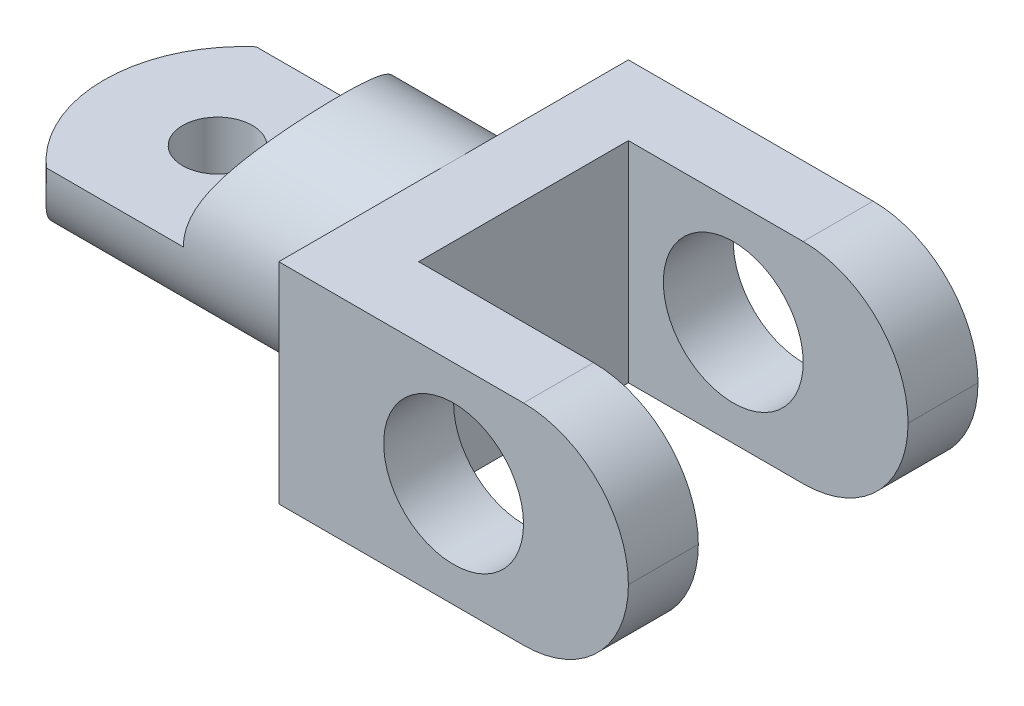
ISO-10303-21;
HEADER;
FILE_DESCRIPTION(('STEP AP214'),'2;1');
FILE_NAME('part.step','',(''),(''),'','','');
FILE_SCHEMA(('AUTOMOTIVE_DESIGN { 1 0 10303 214 1 1 1 1 }'));
ENDSEC;
DATA;
#1=APPLICATION_CONTEXT('core data for automotive mechanical design processes');
#2=APPLICATION_PROTOCOL_DEFINITION('international standard','automotive_design',2000,#1);
#3=PRODUCT_CONTEXT('',#1,'mechanical');
#4=PRODUCT('Part','Part','',(#3));
#5=PRODUCT_RELATED_PRODUCT_CATEGORY('part','',(#4));
#6=PRODUCT_DEFINITION_FORMATION('','',#4);
#7=PRODUCT_DEFINITION_CONTEXT('part definition',#1,'design');
#8=PRODUCT_DEFINITION('design','',#6,#7);
#9=PRODUCT_DEFINITION_SHAPE('','',#8);
#10=(LENGTH_UNIT() NAMED_UNIT(*) SI_UNIT(.MILLI.,.METRE.));
#11=(NAMED_UNIT(*) PLANE_ANGLE_UNIT() SI_UNIT($,.RADIAN.));
#12=(NAMED_UNIT(*) SI_UNIT($,.STERADIAN.) SOLID_ANGLE_UNIT());
#13=UNCERTAINTY_MEASURE_WITH_UNIT(LENGTH_MEASURE(1.E-05),#10,'distance_accuracy_value','');
#14=(GEOMETRIC_REPRESENTATION_CONTEXT(3) GLOBAL_UNCERTAINTY_ASSIGNED_CONTEXT((#13)) GLOBAL_UNIT_ASSIGNED_CONTEXT((#10,
#11,#12)) REPRESENTATION_CONTEXT('',''));
#15=CARTESIAN_POINT('',(0.,0.,0.));
#16=DIRECTION('',(0.,0.,1.));
#17=DIRECTION('',(1.,0.,0.));
#18=AXIS2_PLACEMENT_3D('',#15,#16,#17);
#19=CARTESIAN_POINT('',(-32.93364,0.,0.));
#20=DIRECTION('',(1.,0.,0.));
#21=DIRECTION('',(0.,0.,-1.));
#22=AXIS2_PLACEMENT_3D('',#19,#20,#21);
#23=CYLINDRICAL_SURFACE('',#22,4.70535);
#24=CARTESIAN_POINT('',(-24.7015,-4.70535,0.));
#25=CARTESIAN_POINT('',(-24.7014996161154,-4.70535022983505,-0.0855145321097443));
#26=CARTESIAN_POINT('',(-24.708522031816,-4.70299730140912,-0.171026775501489));
#27=CARTESIAN_POINT('',(-24.7363403430874,-4.69384277612578,-0.339532769312276));
#28=CARTESIAN_POINT('',(-24.7571376906205,-4.68704071030298,-0.422526253274096));
#29=CARTESIAN_POINT('',(-24.8117140692554,-4.66972705620134,-0.583541065045557));
#30=CARTESIAN_POINT('',(-24.8454714207762,-4.65922166525696,-0.661570444089321));
#31=CARTESIAN_POINT('',(-24.9249116493427,-4.63557382539462,-0.810859955176995));
#32=CARTESIAN_POINT('',(-24.9705968728639,-4.62243085772497,-0.88211875153175));
#33=CARTESIAN_POINT('',(-25.074255385149,-4.59438283560297,-1.01830874385799));
#34=CARTESIAN_POINT('',(-25.1325673383853,-4.57943562302643,-1.08297343938973));
#35=CARTESIAN_POINT('',(-25.2591039716202,-4.54969587110564,-1.2018094072363));
#36=CARTESIAN_POINT('',(-25.3273308240588,-4.53490336642264,-1.25597837376121));
#37=CARTESIAN_POINT('',(-25.4741586183399,-4.50668415572133,-1.3538055365009));
#38=CARTESIAN_POINT('',(-25.553001090004,-4.49330882955565,-1.39711747366414));
#39=CARTESIAN_POINT('',(-25.7173684990934,-4.47007929007992,-1.46975327892674));
#40=CARTESIAN_POINT('',(-25.802891391783,-4.46022400446645,-1.49908140780102));
#41=CARTESIAN_POINT('',(-25.9751619234297,-4.44559428864523,-1.54191764886191));
#42=CARTESIAN_POINT('',(-26.0617714328357,-4.44065999807536,-1.5559250491025));
#43=CARTESIAN_POINT('',(-26.2362411160881,-4.43595811225604,-1.56928300963242));
#44=CARTESIAN_POINT('',(-26.3241008958487,-4.43618892349954,-1.56863809036889));
#45=CARTESIAN_POINT('',(-26.4943203358822,-4.44165105751254,-1.55309742623159));
#46=CARTESIAN_POINT('',(-26.5767480731511,-4.4466538044265,-1.53885306688115));
#47=CARTESIAN_POINT('',(-26.7379692006308,-4.4607221406621,-1.49758041321599));
#48=CARTESIAN_POINT('',(-26.8167621551307,-4.46978821567704,-1.47055059062181));
#49=CARTESIAN_POINT('',(-26.9699579684025,-4.4911247310606,-1.40404742230473));
#50=CARTESIAN_POINT('',(-27.0442698267487,-4.50344436794388,-1.36438091610808));
#51=CARTESIAN_POINT('',(-27.1853885784615,-4.52987926004596,-1.2738644704627));
#52=CARTESIAN_POINT('',(-27.2521932984569,-4.54399503275005,-1.22301130493217));
#53=CARTESIAN_POINT('',(-27.3800619304809,-4.57333118522814,-1.10843575537268));
#54=CARTESIAN_POINT('',(-27.4406451888607,-4.5885707926264,-1.04418078902495));
#55=CARTESIAN_POINT('',(-27.5503016112722,-4.61779385717256,-0.906235685442383));
#56=CARTESIAN_POINT('',(-27.5993736749787,-4.63177719415809,-0.832544647277906));
#57=CARTESIAN_POINT('',(-27.6850008965941,-4.65709521708252,-0.676800988068298));
#58=CARTESIAN_POINT('',(-27.721427457705,-4.66840233909108,-0.594672876408155));
#59=CARTESIAN_POINT('',(-27.7797989886726,-4.68689381864689,-0.424987999705921));
#60=CARTESIAN_POINT('',(-27.8017489805306,-4.69407960579495,-0.337433128779434));
#61=CARTESIAN_POINT('',(-27.8296931846708,-4.70328204077229,-0.163449314074051));
#62=CARTESIAN_POINT('',(-27.8363369096445,-4.7055089690086,-0.0771356729421199));
#63=CARTESIAN_POINT('',(-27.8353299327732,-4.70517332630032,0.0953902095652675));
#64=CARTESIAN_POINT('',(-27.8276816393399,-4.7026115623196,0.181602465575892));
#65=CARTESIAN_POINT('',(-27.7988217621485,-4.69312515144589,0.348879971030113));
#66=CARTESIAN_POINT('',(-27.778008690851,-4.6863287783241,0.43002196531827));
#67=CARTESIAN_POINT('',(-27.7239081553653,-4.66918612874413,0.587629898466098));
#68=CARTESIAN_POINT('',(-27.690619100925,-4.65883939975374,0.664095239769904));
#69=CARTESIAN_POINT('',(-27.6115415175446,-4.63530841316891,0.812419224255344));
#70=CARTESIAN_POINT('',(-27.5654474908519,-4.62205673068844,0.884103991694245));
#71=CARTESIAN_POINT('',(-27.4624274408014,-4.59421835785716,1.01893252593397));
#72=CARTESIAN_POINT('',(-27.4054981140415,-4.57963126107889,1.08207367793754));
#73=CARTESIAN_POINT('',(-27.2793691187437,-4.54992745805763,1.20100316857154));
#74=CARTESIAN_POINT('',(-27.2097300069561,-4.53481674147844,1.25632807925136));
#75=CARTESIAN_POINT('',(-27.0618320895245,-4.506450801977,1.35456366460611));
#76=CARTESIAN_POINT('',(-26.9835732152667,-4.4931955938266,1.39747424045244));
#77=CARTESIAN_POINT('',(-26.820626194912,-4.47017117837993,1.46946324868461));
#78=CARTESIAN_POINT('',(-26.7359516528387,-4.46039483213322,1.49857004905754));
#79=CARTESIAN_POINT('',(-26.5625022115977,-4.44557652053025,1.54198068166263));
#80=CARTESIAN_POINT('',(-26.4737291744537,-4.4405324270031,1.55629116833317));
#81=CARTESIAN_POINT('',(-26.2995015503959,-4.4359914676265,1.56918454505362));
#82=CARTESIAN_POINT('',(-26.2141103138388,-4.43622333499205,1.5685365107298));
#83=CARTESIAN_POINT('',(-26.0447210861262,-4.44153764745703,1.55342351923217));
#84=CARTESIAN_POINT('',(-25.9607230126049,-4.4466198047527,1.53895938187045));
#85=CARTESIAN_POINT('',(-25.7980864293147,-4.46086025054263,1.49716875271142));
#86=CARTESIAN_POINT('',(-25.7193765615461,-4.46993955330204,1.47009093913399));
#87=CARTESIAN_POINT('',(-25.5675569147976,-4.4911222348777,1.40404303829217));
#88=CARTESIAN_POINT('',(-25.4944483820726,-4.50322628413912,1.36507031405663));
#89=CARTESIAN_POINT('',(-25.352453598754,-4.52975222752959,1.27435712414189));
#90=CARTESIAN_POINT('',(-25.283890171246,-4.54425214120793,1.22213428702373));
#91=CARTESIAN_POINT('',(-25.1562514852743,-4.57360871845319,1.10721923512823));
#92=CARTESIAN_POINT('',(-25.0971789168276,-4.58846548179615,1.04452406238552));
#93=CARTESIAN_POINT('',(-24.9878838272265,-4.61755533456804,0.907516333421731));
#94=CARTESIAN_POINT('',(-24.9380947810946,-4.63174170563494,0.832846822697227));
#95=CARTESIAN_POINT('',(-24.8518294493216,-4.65725529047547,0.675731748113261));
#96=CARTESIAN_POINT('',(-24.8153497350661,-4.66858324037422,0.593288193820456));
#97=CARTESIAN_POINT('',(-24.7582870844583,-4.68666745409472,0.426797157270762));
#98=CARTESIAN_POINT('',(-24.7370600086526,-4.69360725257518,0.342990704812426));
#99=CARTESIAN_POINT('',(-24.7086685953471,-4.70294778486534,0.172788243385497));
#100=CARTESIAN_POINT('',(-24.7015003878279,-4.70534976780404,0.0863929537028502));
#101=CARTESIAN_POINT('',(-24.7015,-4.70535,0.));
#102=B_SPLINE_CURVE_WITH_KNOTS('',3,(#24,#25,#26,#27,#28,#29,#30,#31,#32,#33,#34,#35,#36,#37,
#38,#39,#40,#41,#42,#43,#44,#45,#46,#47,#48,#49,#50,#51,#52,#53,#54,#55,#56,#57,#58,#59,#60,#61,
#62,#63,#64,#65,#66,#67,#68,#69,#70,#71,#72,#73,#74,#75,#76,#77,#78,#79,#80,#81,#82,#83,#84,#85,
#86,#87,#88,#89,#90,#91,#92,#93,#94,#95,#96,#97,#98,#99,#100,#101),.UNSPECIFIED.,.T.,.F.,(4,2,2,
2,2,2,2,2,2,2,2,2,2,2,2,2,2,2,2,2,2,2,2,2,2,2,2,2,2,2,2,2,2,2,2,2,2,2,4),(0.,0.256225681443812,
0.51247837494287,0.768304261961474,1.02418051354471,1.28803329043318,1.5519439671564,
1.82342852197953,2.09483030429034,2.35709640988729,2.61928160379203,2.86950736278113,
3.11976303946304,3.37404407341133,3.62839853494279,3.89600931213361,4.16364565912808,
4.43392902400873,4.70411857671873,4.96261312679493,5.22106412072831,5.47204319705912,
5.72305427534544,5.98066197758932,6.2383483439136,6.50772315789241,6.77710011626377,
7.04592105600955,7.31462104458194,7.56953840677607,7.82444064376767,8.07451737801236,
8.32464959184241,8.58568179091256,8.84678784494166,9.11804740906181,9.38923704463375,
9.64816601120148,9.90702369174224),.UNSPECIFIED.);
#103=CARTESIAN_POINT('',(-24.7015,-4.70535,0.));
#104=VERTEX_POINT('',#103);
#105=EDGE_CURVE('E160',#104,#104,#102,.T.);
#106=ORIENTED_EDGE('',*,*,#105,.T.);
#107=EDGE_LOOP('',(#106));
#108=FACE_BOUND('',#107,.T.);
#109=CARTESIAN_POINT('',(-15.68196,0.,0.));
#110=DIRECTION('',(-1.,0.,0.));
#111=DIRECTION('',(0.,0.,1.));
#112=AXIS2_PLACEMENT_3D('',#109,#110,#111);
#113=CIRCLE('',#112,4.70535);
#114=CARTESIAN_POINT('',(-15.68196,4.70535,0.));
#115=VERTEX_POINT('',#114);
#116=CARTESIAN_POINT('',(-15.68196,-4.70535,0.));
#117=VERTEX_POINT('',#116);
#118=EDGE_CURVE('E154',#115,#117,#113,.T.);
#119=ORIENTED_EDGE('',*,*,#118,.T.);
#120=EDGE_CURVE('E193',#117,#115,#113,.T.);
#121=ORIENTED_EDGE('',*,*,#120,.T.);
#122=EDGE_LOOP('',(#119,#121));
#123=FACE_BOUND('',#122,.T.);
#124=DIRECTION('',(1.,0.,0.));
#125=VECTOR('',#124,1.);
#126=CARTESIAN_POINT('',(-32.93364,0.0012699999999994,-4.70534982860998));
#127=LINE('',#126,#125);
#128=CARTESIAN_POINT('',(-23.0988410169119,0.0012699999999994,-4.70534982860998));
#129=VERTEX_POINT('',#128);
#130=CARTESIAN_POINT('',(-29.2423888381773,0.0012699999999994,-4.70534982860998));
#131=VERTEX_POINT('',#130);
#132=EDGE_CURVE('E155',#129,#131,#127,.F.);
#133=ORIENTED_EDGE('',*,*,#132,.F.);
#134=CARTESIAN_POINT('',(-23.0988410169119,0.0012699999999994,-4.70534982860998));
#135=CARTESIAN_POINT('',(-23.0988657554299,0.0909475151243943,-4.70534634674592));
#136=CARTESIAN_POINT('',(-23.0953910276751,0.180588645750009,-4.70273871759652));
#137=CARTESIAN_POINT('',(-23.0818847629461,0.358938644952971,-4.69248267383832));
#138=CARTESIAN_POINT('',(-23.0718642655318,0.447648828102165,-4.68484274611233));
#139=CARTESIAN_POINT('',(-23.0458784004873,0.622422742377658,-4.66482153823005));
#140=CARTESIAN_POINT('',(-23.0299932509388,0.708505949799684,-4.65250417496624));
#141=CARTESIAN_POINT('',(-22.992953125703,0.878778823112358,-4.62336783487542));
#142=CARTESIAN_POINT('',(-22.9717955593506,0.962967535881819,-4.60654664473583));
#143=CARTESIAN_POINT('',(-22.9166803848137,1.15852863915808,-4.56195589137762));
#144=CARTESIAN_POINT('',(-22.8808431438713,1.26897087872348,-4.53241865680864));
#145=CARTESIAN_POINT('',(-22.8028019025787,1.48533143299549,-4.46619752977552));
#146=CARTESIAN_POINT('',(-22.7605957058307,1.59124817080589,-4.42951117058777));
#147=CARTESIAN_POINT('',(-22.6264256041167,1.90351618611349,-4.30894436285809));
#148=CARTESIAN_POINT('',(-22.5273495568761,2.10297753581323,-4.2148888388495));
#149=CARTESIAN_POINT('',(-22.3546143730915,2.42195211062431,-4.03685395813513));
#150=CARTESIAN_POINT('',(-22.2830893606705,2.54646974586862,-3.95944228105172));
#151=CARTESIAN_POINT('',(-22.1387004671473,2.7873469870482,-3.79372955695013));
#152=CARTESIAN_POINT('',(-22.0658361295731,2.9037037439761,-3.70542473646463));
#153=CARTESIAN_POINT('',(-21.9210271727023,3.12776531567731,-3.51833159784601));
#154=CARTESIAN_POINT('',(-21.849080956053,3.23548761750763,-3.41956546002147));
#155=CARTESIAN_POINT('',(-21.7077612725796,3.4420982312789,-3.21150698145381));
#156=CARTESIAN_POINT('',(-21.6383881221965,3.54098545875723,-3.10221335192417));
#157=CARTESIAN_POINT('',(-21.4631368420728,3.78632465232271,-2.80370491957426));
#158=CARTESIAN_POINT('',(-21.3606061832336,3.92529627766446,-2.60618689876626));
#159=CARTESIAN_POINT('',(-21.1738541093168,4.17397008824256,-2.18580217327114));
#160=CARTESIAN_POINT('',(-21.0896077093681,4.28371226183729,-1.96297070149543));
#161=CARTESIAN_POINT('',(-20.9578844644816,4.45353351117444,-1.53323364460917));
#162=CARTESIAN_POINT('',(-20.9066742099656,4.51875965221693,-1.32952421193926));
#163=CARTESIAN_POINT('',(-20.8257753666274,4.62132023243213,-0.911059259720844));
#164=CARTESIAN_POINT('',(-20.796074513007,4.65867056694024,-0.69631011002943));
#165=CARTESIAN_POINT('',(-20.7606222491877,4.70321632081256,-0.260950977390391));
#166=CARTESIAN_POINT('',(-20.7549526294951,4.71030875770114,-0.0403235466377385));
#167=CARTESIAN_POINT('',(-20.7683092439565,4.69355385492371,0.398991155754634));
#168=CARTESIAN_POINT('',(-20.787336675558,4.66970501505613,0.617678332802662));
#169=CARTESIAN_POINT('',(-20.8467442584414,4.59476365295197,1.03490227911205));
#170=CARTESIAN_POINT('',(-20.8859297972039,4.54519410189197,1.23389146416722));
#171=CARTESIAN_POINT('',(-20.9820947862974,4.42238992044573,1.61982739337999));
#172=CARTESIAN_POINT('',(-21.0390795127712,4.34914827280951,1.80677054693319));
#173=CARTESIAN_POINT('',(-21.1736615519921,4.17383676953626,2.18326399505947));
#174=CARTESIAN_POINT('',(-21.252725233109,4.06965493942037,2.37129721605742));
#175=CARTESIAN_POINT('',(-21.4233499839093,3.84005265181976,2.72750660049095));
#176=CARTESIAN_POINT('',(-21.5149153784451,3.71462484085475,2.89567585445519));
#177=CARTESIAN_POINT('',(-21.725555358748,3.41755863516449,3.24395453673368));
#178=CARTESIAN_POINT('',(-21.846417742245,3.24172002985135,3.41942425488972));
#179=CARTESIAN_POINT('',(-22.0298535425632,2.95991615910607,3.65985085459584));
#180=CARTESIAN_POINT('',(-22.0914485595907,2.86281680653403,3.73629285873797));
#181=CARTESIAN_POINT('',(-22.2141352289726,2.66267701070689,3.88146222834917));
#182=CARTESIAN_POINT('',(-22.2752269346418,2.55963720620681,3.95019042092295));
#183=CARTESIAN_POINT('',(-22.3893276221195,2.35853615947102,4.07308868194628));
#184=CARTESIAN_POINT('',(-22.4425225267463,2.26104976054067,4.1280289557518));
#185=CARTESIAN_POINT('',(-22.5461771982672,2.06126255585368,4.23133051323279));
#186=CARTESIAN_POINT('',(-22.5966375280868,1.95896274912322,4.27969315406438));
#187=CARTESIAN_POINT('',(-22.6931007025509,1.75009596771034,4.36924657300909));
#188=CARTESIAN_POINT('',(-22.7391288280624,1.64355878316777,4.41047924481135));
#189=CARTESIAN_POINT('',(-22.8253714197124,1.42563726714236,4.48566093507793));
#190=CARTESIAN_POINT('',(-22.8655867965046,1.31425369848275,4.51961109486044));
#191=CARTESIAN_POINT('',(-22.9319961008841,1.106374644482,4.57446614074584));
#192=CARTESIAN_POINT('',(-22.9594118539466,1.0105990527767,4.59660956943875));
#193=CARTESIAN_POINT('',(-23.0076884855344,0.816305181277628,4.6350585036011));
#194=CARTESIAN_POINT('',(-23.0285538799964,0.71778884223991,4.65136803215408));
#195=CARTESIAN_POINT('',(-23.0628720093422,0.517042827937659,4.67796563447762));
#196=CARTESIAN_POINT('',(-23.0762050031676,0.414779278305618,4.68815659345317));
#197=CARTESIAN_POINT('',(-23.0942309768567,0.208793097816997,4.70186111301328));
#198=CARTESIAN_POINT('',(-23.0989014575419,0.1050673705098,4.70535728596538));
#199=CARTESIAN_POINT('',(-23.0988410169118,0.00126999999995225,4.70534982861001));
#200=B_SPLINE_CURVE_WITH_KNOTS('',3,(#134,#135,#136,#137,#138,#139,#140,#141,#142,#143,#144,
#145,#146,#147,#148,#149,#150,#151,#152,#153,#154,#155,#156,#157,#158,#159,#160,#161,#162,#163,
#164,#165,#166,#167,#168,#169,#170,#171,#172,#173,#174,#175,#176,#177,#178,#179,#180,#181,#182,
#183,#184,#185,#186,#187,#188,#189,#190,#191,#192,#193,#194,#195,#196,#197,#198,#199),
.UNSPECIFIED.,.F.,.F.,(4,2,2,2,2,2,2,2,2,2,2,2,2,2,2,2,2,2,2,2,2,2,2,2,2,2,2,2,2,2,2,2,4),(0.,
0.268874197636215,0.537296100716804,0.802174842313111,1.06718399276845,1.42603073555568,
1.78500151423531,2.50742609393122,2.99637127648818,3.48548631150681,3.97358432120223,
4.46174216049368,5.24565355624022,6.02848692126835,6.685505846355,7.34214983943332,
8.00102694021548,8.6599359881413,9.28365592789638,9.90756093022912,10.5921885753029,
11.2770536639379,12.1025577067681,12.5165363679208,12.9304705981884,13.3019103859731,
13.673273418332,14.0423742448523,14.4114171834124,14.717214257313,15.0228000437777,
15.3331160367633,15.6442368920448),.UNSPECIFIED.);
#201=CARTESIAN_POINT('',(-23.0988410169119,0.0012699999999994,4.70534982860998));
#202=VERTEX_POINT('',#201);
#203=EDGE_CURVE('E159',#129,#202,#200,.T.);
#204=ORIENTED_EDGE('',*,*,#203,.T.);
#205=DIRECTION('',(1.,0.,0.));
#206=VECTOR('',#205,1.);
#207=CARTESIAN_POINT('',(-32.93364,0.0012699999999994,4.70534982860998));
#208=LINE('',#207,#206);
#209=CARTESIAN_POINT('',(-29.2423888381773,0.0012699999999994,4.70534982860998));
#210=VERTEX_POINT('',#209);
#211=EDGE_CURVE('E143',#210,#202,#208,.T.);
#212=ORIENTED_EDGE('',*,*,#211,.F.);
#213=CARTESIAN_POINT('',(-29.2423886438392,0.,-4.70535));
#214=CARTESIAN_POINT('',(-29.2423781036386,0.109852184350706,-4.70535526424458));
#215=CARTESIAN_POINT('',(-29.2467697314219,0.219667110233113,-4.70149598803322));
#216=CARTESIAN_POINT('',(-29.2640348971921,0.438134546105287,-4.68618591239452));
#217=CARTESIAN_POINT('',(-29.2769112650729,0.54678665597282,-4.67473258013305));
#218=CARTESIAN_POINT('',(-29.3104387953515,0.762074678935267,-4.64450325701784));
#219=CARTESIAN_POINT('',(-29.3311070631425,0.868705610099921,-4.62571115223157));
#220=CARTESIAN_POINT('',(-29.3791500944313,1.07900131706475,-4.58122711366669));
#221=CARTESIAN_POINT('',(-29.4065289797152,1.1826642259806,-4.55553093834289));
#222=CARTESIAN_POINT('',(-29.4960578370946,1.48542183731978,-4.46960823938729));
#223=CARTESIAN_POINT('',(-29.5661796514996,1.67957591940202,-4.40006089981239));
#224=CARTESIAN_POINT('',(-29.7191712849193,2.05265823040149,-4.2389033156919));
#225=CARTESIAN_POINT('',(-29.8020395627461,2.231588296013,-4.14729573771566));
#226=CARTESIAN_POINT('',(-29.9917798862866,2.61023390112124,-3.92238679142222));
#227=CARTESIAN_POINT('',(-30.1000441907871,2.806453639202,-3.78437143264363));
#228=CARTESIAN_POINT('',(-30.3162773177348,3.1762213835291,-3.47984731687057));
#229=CARTESIAN_POINT('',(-30.4242454637009,3.34973532938806,-3.31329659965258));
#230=CARTESIAN_POINT('',(-30.5906794167916,3.60740586030013,-3.02458140691122));
#231=CARTESIAN_POINT('',(-30.6517687958237,3.69967377677122,-2.91107483331235));
#232=CARTESIAN_POINT('',(-30.7694405678904,3.87424321041122,-2.67435764427401));
#233=CARTESIAN_POINT('',(-30.8260219464024,3.95654248630038,-2.5511448567958));
#234=CARTESIAN_POINT('',(-30.9329711277542,4.10998819208495,-2.29574666656814));
#235=CARTESIAN_POINT('',(-30.9833505912573,4.18115562214094,-2.16357884966529));
#236=CARTESIAN_POINT('',(-31.0764522235572,4.31133228505023,-1.89091540046174));
#237=CARTESIAN_POINT('',(-31.1191784415112,4.37034794961106,-1.75042422453345));
#238=CARTESIAN_POINT('',(-31.2106408829479,4.49577231048035,-1.40501669128488));
#239=CARTESIAN_POINT('',(-31.2550779120762,4.55588373664077,-1.19658392023833));
#240=CARTESIAN_POINT('',(-31.3227332521544,4.64698787934182,-0.770248195668842));
#241=CARTESIAN_POINT('',(-31.3459699975754,4.67800589439448,-0.552353642604854));
#242=CARTESIAN_POINT('',(-31.3693228428584,4.7091783554257,-0.112512137753899));
#243=CARTESIAN_POINT('',(-31.369378865691,4.70925260505101,0.109443852952974));
#244=CARTESIAN_POINT('',(-31.3462030666501,4.67831751825663,0.549951084721422));
#245=CARTESIAN_POINT('',(-31.3229658517741,4.64730098349551,0.768501525407665));
#246=CARTESIAN_POINT('',(-31.2563977135414,4.55766107222342,1.18853712538534));
#247=CARTESIAN_POINT('',(-31.2137822504962,4.50001960353206,1.39035039647423));
#248=CARTESIAN_POINT('',(-31.111815564027,4.36030511636022,1.78075672405692));
#249=CARTESIAN_POINT('',(-31.0524606915347,4.27822677060259,1.96934688680531));
#250=CARTESIAN_POINT('',(-30.9135231900889,4.08258089297266,2.35021983096924));
#251=CARTESIAN_POINT('',(-30.8324462316971,3.96656608597694,2.5406914254123));
#252=CARTESIAN_POINT('',(-30.6594296510195,3.71179406730549,2.90026988676098));
#253=CARTESIAN_POINT('',(-30.5674807908019,3.5730174754529,3.06935832812024));
#254=CARTESIAN_POINT('',(-30.3592977087115,3.24596389883925,3.41636446557974));
#255=CARTESIAN_POINT('',(-30.241844352633,3.05331966804005,3.58947565923654));
#256=CARTESIAN_POINT('',(-30.0672388311909,2.74468950466984,3.82409583222164));
#257=CARTESIAN_POINT('',(-30.0092611961918,2.63845790923503,3.89816922573013));
#258=CARTESIAN_POINT('',(-29.89530972759,2.41949100776033,4.03772563540655));
#259=CARTESIAN_POINT('',(-29.8393354483853,2.30675716275422,4.10321057062932));
#260=CARTESIAN_POINT('',(-29.6982529727591,2.00460810451473,4.26217811297028));
#261=CARTESIAN_POINT('',(-29.615998341133,1.81005106987703,4.34864134162991));
#262=CARTESIAN_POINT('',(-29.4697842119119,1.40510733000532,4.49579373379173));
#263=CARTESIAN_POINT('',(-29.4057834769492,1.19475768308128,4.55654114478818));
#264=CARTESIAN_POINT('',(-29.3161845079045,0.804032003647592,4.63954843488105));
#265=CARTESIAN_POINT('',(-29.2854891143029,0.625978170863034,4.66705012143081));
#266=CARTESIAN_POINT('',(-29.2470316941374,0.265520816202033,4.70132776783651));
#267=CARTESIAN_POINT('',(-29.2392403268556,0.0831231612839006,4.70813024436992));
#268=CARTESIAN_POINT('',(-29.2478880907919,-0.280687732442082,4.70049573090491));
#269=CARTESIAN_POINT('',(-29.2643361406798,-0.462100584247259,4.68605092316795));
#270=CARTESIAN_POINT('',(-29.318728750488,-0.818964817820973,4.63704654133944));
#271=CARTESIAN_POINT('',(-29.3567099991974,-0.994405481805163,4.60245263396248));
#272=CARTESIAN_POINT('',(-29.4663752428529,-1.4001436349593,4.49874399073932));
#273=CARTESIAN_POINT('',(-29.545352965329,-1.62639498407808,4.42155476298703));
#274=CARTESIAN_POINT('',(-29.676891297273,-1.95057026273838,4.28362828343601));
#275=CARTESIAN_POINT('',(-29.7229834723367,-2.05622057873387,4.23388439630259));
#276=CARTESIAN_POINT('',(-29.8182028767563,-2.26248800994113,4.12733744152157));
#277=CARTESIAN_POINT('',(-29.8673298317845,-2.36310557860229,4.07053501145974));
#278=CARTESIAN_POINT('',(-30.0209286377155,-2.66425313262267,3.88573249206578));
#279=CARTESIAN_POINT('',(-30.1283866507885,-2.85652149864566,3.74657129089246));
#280=CARTESIAN_POINT('',(-30.3422133211457,-3.21850876766912,3.44058960286626));
#281=CARTESIAN_POINT('',(-30.4485814224061,-3.38821664306392,3.27375567844108));
#282=CARTESIAN_POINT('',(-30.6129071464193,-3.64117152326026,2.98385658332705));
#283=CARTESIAN_POINT('',(-30.673554852661,-3.73231053100655,2.86912555524978));
#284=CARTESIAN_POINT('',(-30.790147807959,-3.9045032138558,2.6299971308481));
#285=CARTESIAN_POINT('',(-30.8460919886437,-3.98555459962638,2.50559755066497));
#286=CARTESIAN_POINT('',(-30.9515848109429,-4.13638108049479,2.24786807062359));
#287=CARTESIAN_POINT('',(-31.0011442192252,-4.20617521020173,2.1145537961438));
#288=CARTESIAN_POINT('',(-31.0924122011603,-4.33344441706307,1.83970607131538));
#289=CARTESIAN_POINT('',(-31.1341250103963,-4.39092614277319,1.69817710954846));
#290=CARTESIAN_POINT('',(-31.2227221080446,-4.51217884140658,1.35133510660751));
#291=CARTESIAN_POINT('',(-31.2652967763868,-4.56968503622855,1.14264216540159));
#292=CARTESIAN_POINT('',(-31.329152403373,-4.65557895598727,0.716330353006355));
#293=CARTESIAN_POINT('',(-31.3504523995692,-4.68399271474263,0.498719643734798));
#294=CARTESIAN_POINT('',(-31.3700189244408,-4.71010263649891,0.0600711460473843));
#295=CARTESIAN_POINT('',(-31.3682313830446,-4.7077266912251,-0.16097347592317));
#296=CARTESIAN_POINT('',(-31.3416419215364,-4.6722223600837,-0.599178024248241));
#297=CARTESIAN_POINT('',(-31.3168338703601,-4.63908578171974,-0.816336900004577));
#298=CARTESIAN_POINT('',(-31.2473641544198,-4.54544639418937,-1.23443856403377));
#299=CARTESIAN_POINT('',(-31.2032997507176,-4.48576595761728,-1.43566909732061));
#300=CARTESIAN_POINT('',(-31.0986544625672,-4.34213489065645,-1.82461327161248));
#301=CARTESIAN_POINT('',(-31.0380700452976,-4.25817906872005,-2.0123240105293));
#302=CARTESIAN_POINT('',(-30.8964770890247,-4.05827506370006,-2.39203718672393));
#303=CARTESIAN_POINT('',(-30.8139323509719,-3.93978014586625,-2.58211704182964));
#304=CARTESIAN_POINT('',(-30.6382496919548,-3.68000915616872,-2.94057122162306));
#305=CARTESIAN_POINT('',(-30.5451020584217,-3.53871214661584,-3.1089253387992));
#306=CARTESIAN_POINT('',(-30.3345960885004,-3.20586584747915,-3.45413910803823));
#307=CARTESIAN_POINT('',(-30.216093560059,-3.00990501326831,-3.62609295405568));
#308=CARTESIAN_POINT('',(-30.0405692564001,-2.69610991589087,-3.85853102931374));
#309=CARTESIAN_POINT('',(-29.9823966082554,-2.58812789745498,-3.93179990902248));
#310=CARTESIAN_POINT('',(-29.8683383674077,-2.36558337583163,-4.06957616738607));
#311=CARTESIAN_POINT('',(-29.8124521865648,-2.25102258333573,-4.13408580917493));
#312=CARTESIAN_POINT('',(-29.6741021104853,-1.94845206331329,-4.28798950769134));
#313=CARTESIAN_POINT('',(-29.5945405797188,-1.75563470588434,-4.37074715019409));
#314=CARTESIAN_POINT('',(-29.4539708481826,-1.35485925453353,-4.51103775155104));
#315=CARTESIAN_POINT('',(-29.3929135129119,-1.14694310752562,-4.56863769494486));
#316=CARTESIAN_POINT('',(-29.3128037593604,-0.781763147808629,-4.64252071212601));
#317=CARTESIAN_POINT('',(-29.2866854758488,-0.627509146939627,-4.66596489607549));
#318=CARTESIAN_POINT('',(-29.2514910750155,-0.315476248218974,-4.69737068169173));
#319=CARTESIAN_POINT('',(-29.2424037749614,-0.157699732217153,-4.70534244284522));
#320=CARTESIAN_POINT('',(-29.2423886438392,0.,-4.70535));
#321=B_SPLINE_CURVE_WITH_KNOTS('',3,(#213,#214,#215,#216,#217,#218,#219,#220,#221,#222,#223,
#224,#225,#226,#227,#228,#229,#230,#231,#232,#233,#234,#235,#236,#237,#238,#239,#240,#241,#242,
#243,#244,#245,#246,#247,#248,#249,#250,#251,#252,#253,#254,#255,#256,#257,#258,#259,#260,#261,
#262,#263,#264,#265,#266,#267,#268,#269,#270,#271,#272,#273,#274,#275,#276,#277,#278,#279,#280,
#281,#282,#283,#284,#285,#286,#287,#288,#289,#290,#291,#292,#293,#294,#295,#296,#297,#298,#299,
#300,#301,#302,#303,#304,#305,#306,#307,#308,#309,#310,#311,#312,#313,#314,#315,#316,#317,#318,
#319,#320),.UNSPECIFIED.,.T.,.F.,(4,2,2,2,2,2,2,2,2,2,2,2,2,2,2,2,2,2,2,2,2,2,2,2,2,2,2,2,2,2,2,
2,2,2,2,2,2,2,2,2,2,2,2,2,2,2,2,2,2,2,2,2,2,4),(0.,0.329341031980132,0.658791963872422,
0.988970384146773,1.31935211660749,1.97011978598871,2.62080883215558,3.40778207727017,
4.19592262927497,4.6709082710584,5.14600050785756,5.62018538595676,6.09411863784317,
6.75537144343374,7.41604871447045,8.07843823928268,8.74098116027369,9.38083222787394,
10.020822886265,10.730109792305,11.4400037751532,12.2895466343964,12.7148868712567,
13.1401319051182,13.8225575935824,14.5034291772956,15.0493551436616,15.5945814577148,
16.1400084328532,16.6863675247076,17.4372268723732,17.8136218269328,18.1899828070784,
18.968954956697,19.7483064800419,20.2234537311021,20.6987086184469,21.1731512885521,
21.647337115612,22.306142818463,22.9643584621706,23.6241158990387,24.2840490998969,
24.9248243190726,25.5657366762843,26.2792511542866,26.9934245740438,27.8488783728962,
28.2771479948409,28.7053067528752,29.3762912762552,30.0454781896656,30.5185787442841,
30.9913685468572),.UNSPECIFIED.);
#322=EDGE_CURVE('E166',#210,#131,#321,.T.);
#323=ORIENTED_EDGE('',*,*,#322,.T.);
#324=EDGE_LOOP('',(#133,#204,#212,#323));
#325=FACE_BOUND('',#324,.T.);
#326=ADVANCED_FACE('F32',(#108,#123,#325),#23,.T.);
#327=CARTESIAN_POINT('',(-25.09266,-4.70535,0.));
#328=DIRECTION('',(0.,1.,0.));
#329=DIRECTION('',(0.,0.,1.));
#330=AXIS2_PLACEMENT_3D('',#327,#328,#329);
#331=CYLINDRICAL_SURFACE('',#330,6.27379999999999);
#332=CARTESIAN_POINT('',(-25.09266,0.0012699999999994,0.));
#333=DIRECTION('',(0.,1.,0.));
#334=DIRECTION('',(0.,0.,1.));
#335=AXIS2_PLACEMENT_3D('',#332,#333,#334);
#336=CIRCLE('',#335,6.27379999999999);
#337=EDGE_CURVE('E149',#131,#210,#336,.T.);
#338=ORIENTED_EDGE('',*,*,#337,.F.);
#339=ORIENTED_EDGE('',*,*,#322,.F.);
#340=EDGE_LOOP('',(#338,#339));
#341=FACE_BOUND('',#340,.T.);
#342=ADVANCED_FACE('F184',(#341),#331,.T.);
#343=CARTESIAN_POINT('',(-15.68196,-4.70535,-7.84098));
#344=DIRECTION('',(-1.,0.,0.));
#345=DIRECTION('',(0.,0.,1.));
#346=AXIS2_PLACEMENT_3D('',#343,#344,#345);
#347=PLANE('',#346);
#348=ORIENTED_EDGE('',*,*,#118,.F.);
#349=DIRECTION('',(0.,0.,1.));
#350=VECTOR('',#349,1.);
#351=CARTESIAN_POINT('',(-15.68196,4.70535,-7.84098));
#352=LINE('',#351,#350);
#353=CARTESIAN_POINT('',(-15.68196,4.70535,-7.84098));
#354=VERTEX_POINT('',#353);
#355=EDGE_CURVE('E237',#354,#115,#352,.T.);
#356=ORIENTED_EDGE('',*,*,#355,.F.);
#357=DIRECTION('',(0.,1.,0.));
#358=VECTOR('',#357,1.);
#359=CARTESIAN_POINT('',(-15.68196,-4.70535,-7.84098));
#360=LINE('',#359,#358);
#361=CARTESIAN_POINT('',(-15.68196,-4.70535,-7.84098));
#362=VERTEX_POINT('',#361);
#363=EDGE_CURVE('E203',#362,#354,#360,.T.);
#364=ORIENTED_EDGE('',*,*,#363,.F.);
#365=DIRECTION('',(0.,0.,1.));
#366=VECTOR('',#365,1.);
#367=CARTESIAN_POINT('',(-15.68196,-4.70535,-7.84098));
#368=LINE('',#367,#366);
#369=EDGE_CURVE('E221',#362,#117,#368,.T.);
#370=ORIENTED_EDGE('',*,*,#369,.T.);
#371=EDGE_LOOP('',(#348,#356,#364,#370));
#372=FACE_BOUND('',#371,.T.);
#373=ADVANCED_FACE('F187',(#372),#347,.T.);
#374=CARTESIAN_POINT('',(-12.54506,-4.70535,-4.70408));
#375=DIRECTION('',(1.,0.,0.));
#376=DIRECTION('',(0.,0.,-1.));
#377=AXIS2_PLACEMENT_3D('',#374,#375,#376);
#378=PLANE('',#377);
#379=DIRECTION('',(0.,1.,0.));
#380=VECTOR('',#379,1.);
#381=CARTESIAN_POINT('',(-12.54506,-4.70535,-4.70408));
#382=LINE('',#381,#380);
#383=CARTESIAN_POINT('',(-12.54506,-4.70535,-4.70408));
#384=VERTEX_POINT('',#383);
#385=CARTESIAN_POINT('',(-12.54506,4.70535,-4.70408));
#386=VERTEX_POINT('',#385);
#387=EDGE_CURVE('E194',#384,#386,#382,.T.);
#388=ORIENTED_EDGE('',*,*,#387,.T.);
#389=DIRECTION('',(0.,0.,-1.));
#390=VECTOR('',#389,1.);
#391=CARTESIAN_POINT('',(-12.54506,4.70535,-4.70408));
#392=LINE('',#391,#390);
#393=CARTESIAN_POINT('',(-12.54506,4.70535,4.70408));
#394=VERTEX_POINT('',#393);
#395=EDGE_CURVE('E245',#394,#386,#392,.T.);
#396=ORIENTED_EDGE('',*,*,#395,.F.);
#397=DIRECTION('',(0.,1.,0.));
#398=VECTOR('',#397,1.);
#399=CARTESIAN_POINT('',(-12.54506,-4.70535,4.70408));
#400=LINE('',#399,#398);
#401=CARTESIAN_POINT('',(-12.54506,-4.70535,4.70408));
#402=VERTEX_POINT('',#401);
#403=EDGE_CURVE('E214',#402,#394,#400,.T.);
#404=ORIENTED_EDGE('',*,*,#403,.F.);
#405=DIRECTION('',(0.,0.,-1.));
#406=VECTOR('',#405,1.);
#407=CARTESIAN_POINT('',(-12.54506,-4.70535,-4.70408));
#408=LINE('',#407,#406);
#409=EDGE_CURVE('E230',#402,#384,#408,.T.);
#410=ORIENTED_EDGE('',*,*,#409,.T.);
#411=EDGE_LOOP('',(#388,#396,#404,#410));
#412=FACE_BOUND('',#411,.T.);
#413=ADVANCED_FACE('F350',(#412),#378,.T.);
#414=CARTESIAN_POINT('',(-12.54506,-4.70535,4.70408));
#415=DIRECTION('',(0.,0.,-1.));
#416=DIRECTION('',(-1.,0.,0.));
#417=AXIS2_PLACEMENT_3D('',#414,#415,#416);
#418=PLANE('',#417);
#419=CARTESIAN_POINT('',(-7.84098,0.,4.70408));
#420=DIRECTION('',(0.,0.,-1.));
#421=DIRECTION('',(-1.,0.,0.));
#422=AXIS2_PLACEMENT_3D('',#419,#420,#421);
#423=CIRCLE('',#422,3.1369);
#424=CARTESIAN_POINT('',(-10.97788,0.,4.70408));
#425=VERTEX_POINT('',#424);
#426=EDGE_CURVE('E522',#425,#425,#423,.T.);
#427=ORIENTED_EDGE('',*,*,#426,.F.);
#428=EDGE_LOOP('',(#427));
#429=FACE_BOUND('',#428,.T.);
#430=DIRECTION('',(0.,1.,0.));
#431=VECTOR('',#430,1.);
#432=CARTESIAN_POINT('',(0.,-4.70535,4.70408));
#433=LINE('',#432,#431);
#434=CARTESIAN_POINT('',(0.,-0.00127000000000113,4.70408));
#435=VERTEX_POINT('',#434);
#436=CARTESIAN_POINT('',(0.,0.00126999999999766,4.70408));
#437=VERTEX_POINT('',#436);
#438=EDGE_CURVE('E211',#435,#437,#433,.T.);
#439=ORIENTED_EDGE('',*,*,#438,.F.);
#440=CARTESIAN_POINT('',(-4.70408,-0.0012699999999994,4.70408));
#441=DIRECTION('',(0.,0.,-1.));
#442=DIRECTION('',(-1.,0.,0.));
#443=AXIS2_PLACEMENT_3D('',#440,#441,#442);
#444=CIRCLE('',#443,4.70408);
#445=CARTESIAN_POINT('',(-4.70408,-4.70535,4.70408));
#446=VERTEX_POINT('',#445);
#447=EDGE_CURVE('E307',#435,#446,#444,.T.);
#448=ORIENTED_EDGE('',*,*,#447,.T.);
#449=DIRECTION('',(-1.,0.,0.));
#450=VECTOR('',#449,1.);
#451=CARTESIAN_POINT('',(-12.54506,-4.70535,4.70408));
#452=LINE('',#451,#450);
#453=EDGE_CURVE('E197',#446,#402,#452,.T.);
#454=ORIENTED_EDGE('',*,*,#453,.T.);
#455=ORIENTED_EDGE('',*,*,#403,.T.);
#456=DIRECTION('',(-1.,0.,0.));
#457=VECTOR('',#456,1.);
#458=CARTESIAN_POINT('',(-12.54506,4.70535,4.70408));
#459=LINE('',#458,#457);
#460=CARTESIAN_POINT('',(-4.70408,4.70535,4.70408));
#461=VERTEX_POINT('',#460);
#462=EDGE_CURVE('E233',#461,#394,#459,.T.);
#463=ORIENTED_EDGE('',*,*,#462,.F.);
#464=CARTESIAN_POINT('',(-4.70408,0.0012699999999994,4.70408));
#465=DIRECTION('',(0.,0.,-1.));
#466=DIRECTION('',(-1.,0.,0.));
#467=AXIS2_PLACEMENT_3D('',#464,#465,#466);
#468=CIRCLE('',#467,4.70408);
#469=EDGE_CURVE('E56',#461,#437,#468,.T.);
#470=ORIENTED_EDGE('',*,*,#469,.T.);
#471=EDGE_LOOP('',(#439,#448,#454,#455,#463,#470));
#472=FACE_BOUND('',#471,.T.);
#473=ADVANCED_FACE('F353',(#429,#472),#418,.T.);
#474=CARTESIAN_POINT('',(0.,-4.70535,4.70408));
#475=DIRECTION('',(1.,0.,0.));
#476=DIRECTION('',(0.,0.,-1.));
#477=AXIS2_PLACEMENT_3D('',#474,#475,#476);
#478=PLANE('',#477);
#479=DIRECTION('',(0.,1.,0.));
#480=VECTOR('',#479,1.);
#481=CARTESIAN_POINT('',(0.,-4.70535,7.84098));
#482=LINE('',#481,#480);
#483=CARTESIAN_POINT('',(0.,-0.00127000000000113,7.84098));
#484=VERTEX_POINT('',#483);
#485=CARTESIAN_POINT('',(0.,0.00126999999999766,7.84098));
#486=VERTEX_POINT('',#485);
#487=EDGE_CURVE('E209',#484,#486,#482,.T.);
#488=ORIENTED_EDGE('',*,*,#487,.F.);
#489=DIRECTION('',(0.,0.,-1.));
#490=VECTOR('',#489,1.);
#491=CARTESIAN_POINT('',(0.,-0.0012699999999994,4.70408));
#492=LINE('',#491,#490);
#493=EDGE_CURVE('E310',#484,#435,#492,.T.);
#494=ORIENTED_EDGE('',*,*,#493,.T.);
#495=ORIENTED_EDGE('',*,*,#438,.T.);
#496=DIRECTION('',(0.,0.,-1.));
#497=VECTOR('',#496,1.);
#498=CARTESIAN_POINT('',(0.,0.0012699999999994,4.70408));
#499=LINE('',#498,#497);
#500=EDGE_CURVE('E313',#437,#486,#499,.F.);
#501=ORIENTED_EDGE('',*,*,#500,.T.);
#502=EDGE_LOOP('',(#488,#494,#495,#501));
#503=FACE_BOUND('',#502,.T.);
#504=ADVANCED_FACE('F360',(#503),#478,.T.);
#505=CARTESIAN_POINT('',(-15.68196,-4.70535,7.84098));
#506=DIRECTION('',(0.,0.,1.));
#507=DIRECTION('',(1.,0.,0.));
#508=AXIS2_PLACEMENT_3D('',#505,#506,#507);
#509=PLANE('',#508);
#510=CARTESIAN_POINT('',(-7.84098,0.,7.84098));
#511=DIRECTION('',(0.,0.,1.));
#512=DIRECTION('',(1.,0.,0.));
#513=AXIS2_PLACEMENT_3D('',#510,#511,#512);
#514=CIRCLE('',#513,3.1369);
#515=CARTESIAN_POINT('',(-4.70408,0.,7.84098));
#516=VERTEX_POINT('',#515);
#517=EDGE_CURVE('E527',#516,#516,#514,.T.);
#518=ORIENTED_EDGE('',*,*,#517,.F.);
#519=EDGE_LOOP('',(#518));
#520=FACE_BOUND('',#519,.T.);
#521=DIRECTION('',(1.,0.,0.));
#522=VECTOR('',#521,1.);
#523=CARTESIAN_POINT('',(-15.68196,-4.70535,7.84098));
#524=LINE('',#523,#522);
#525=CARTESIAN_POINT('',(-15.68196,-4.70535,7.84098));
#526=VERTEX_POINT('',#525);
#527=CARTESIAN_POINT('',(-4.70407999999999,-4.70535,7.84098));
#528=VERTEX_POINT('',#527);
#529=EDGE_CURVE('E218',#526,#528,#524,.T.);
#530=ORIENTED_EDGE('',*,*,#529,.T.);
#531=CARTESIAN_POINT('',(-4.70407999999999,-0.0012699999999994,7.84098));
#532=DIRECTION('',(0.,0.,1.));
#533=DIRECTION('',(1.,0.,0.));
#534=AXIS2_PLACEMENT_3D('',#531,#532,#533);
#535=CIRCLE('',#534,4.70408);
#536=EDGE_CURVE('E302',#528,#484,#535,.T.);
#537=ORIENTED_EDGE('',*,*,#536,.T.);
#538=ORIENTED_EDGE('',*,*,#487,.T.);
#539=CARTESIAN_POINT('',(-4.70407999999999,0.0012699999999994,7.84098));
#540=DIRECTION('',(0.,0.,1.));
#541=DIRECTION('',(1.,0.,0.));
#542=AXIS2_PLACEMENT_3D('',#539,#540,#541);
#543=CIRCLE('',#542,4.70408);
#544=CARTESIAN_POINT('',(-4.70407999999999,4.70535,7.84098));
#545=VERTEX_POINT('',#544);
#546=EDGE_CURVE('E48',#486,#545,#543,.T.);
#547=ORIENTED_EDGE('',*,*,#546,.T.);
#548=DIRECTION('',(1.,0.,0.));
#549=VECTOR('',#548,1.);
#550=CARTESIAN_POINT('',(-15.68196,4.70535,7.84098));
#551=LINE('',#550,#549);
#552=CARTESIAN_POINT('',(-15.68196,4.70535,7.84098));
#553=VERTEX_POINT('',#552);
#554=EDGE_CURVE('E235',#553,#545,#551,.T.);
#555=ORIENTED_EDGE('',*,*,#554,.F.);
#556=DIRECTION('',(0.,1.,0.));
#557=VECTOR('',#556,1.);
#558=CARTESIAN_POINT('',(-15.68196,-4.70535,7.84098));
#559=LINE('',#558,#557);
#560=EDGE_CURVE('E206',#526,#553,#559,.T.);
#561=ORIENTED_EDGE('',*,*,#560,.F.);
#562=EDGE_LOOP('',(#530,#537,#538,#547,#555,#561));
#563=FACE_BOUND('',#562,.T.);
#564=ADVANCED_FACE('F298',(#520,#563),#509,.T.);
#565=ORIENTED_EDGE('',*,*,#120,.F.);
#566=EDGE_CURVE('E224',#117,#526,#368,.T.);
#567=ORIENTED_EDGE('',*,*,#566,.T.);
#568=ORIENTED_EDGE('',*,*,#560,.T.);
#569=EDGE_CURVE('E239',#115,#553,#352,.T.);
#570=ORIENTED_EDGE('',*,*,#569,.F.);
#571=EDGE_LOOP('',(#565,#567,#568,#570));
#572=FACE_BOUND('',#571,.T.);
#573=ADVANCED_FACE('F296',(#572),#347,.T.);
#574=CARTESIAN_POINT('',(-15.68196,-4.70535,-7.84098));
#575=DIRECTION('',(0.,0.,-1.));
#576=DIRECTION('',(-1.,0.,0.));
#577=AXIS2_PLACEMENT_3D('',#574,#575,#576);
#578=PLANE('',#577);
#579=CARTESIAN_POINT('',(-7.84098,0.,-7.84098));
#580=DIRECTION('',(0.,0.,1.));
#581=DIRECTION('',(1.,0.,0.));
#582=AXIS2_PLACEMENT_3D('',#579,#580,#581);
#583=CIRCLE('',#582,3.1369);
#584=CARTESIAN_POINT('',(-4.70408,0.,-7.84098));
#585=VERTEX_POINT('',#584);
#586=EDGE_CURVE('E525',#585,#585,#583,.T.);
#587=ORIENTED_EDGE('',*,*,#586,.T.);
#588=EDGE_LOOP('',(#587));
#589=FACE_BOUND('',#588,.T.);
#590=DIRECTION('',(0.,1.,0.));
#591=VECTOR('',#590,1.);
#592=CARTESIAN_POINT('',(0.,-4.70535,-7.84098));
#593=LINE('',#592,#591);
#594=CARTESIAN_POINT('',(0.,-0.00127000000000113,-7.84098));
#595=VERTEX_POINT('',#594);
#596=CARTESIAN_POINT('',(0.,0.00126999999999766,-7.84098));
#597=VERTEX_POINT('',#596);
#598=EDGE_CURVE('E200',#595,#597,#593,.T.);
#599=ORIENTED_EDGE('',*,*,#598,.F.);
#600=CARTESIAN_POINT('',(-4.70408000000001,-0.0012699999999994,-7.84098));
#601=DIRECTION('',(0.,0.,-1.));
#602=DIRECTION('',(-1.,0.,0.));
#603=AXIS2_PLACEMENT_3D('',#600,#601,#602);
#604=CIRCLE('',#603,4.70408);
#605=CARTESIAN_POINT('',(-4.70408000000001,-4.70535,-7.84098));
#606=VERTEX_POINT('',#605);
#607=EDGE_CURVE('E323',#595,#606,#604,.T.);
#608=ORIENTED_EDGE('',*,*,#607,.T.);
#609=DIRECTION('',(-1.,0.,0.));
#610=VECTOR('',#609,1.);
#611=CARTESIAN_POINT('',(-15.68196,-4.70535,-7.84098));
#612=LINE('',#611,#610);
#613=EDGE_CURVE('E225',#606,#362,#612,.T.);
#614=ORIENTED_EDGE('',*,*,#613,.T.);
#615=ORIENTED_EDGE('',*,*,#363,.T.);
#616=DIRECTION('',(-1.,0.,0.));
#617=VECTOR('',#616,1.);
#618=CARTESIAN_POINT('',(-15.68196,4.70535,-7.84098));
#619=LINE('',#618,#617);
#620=CARTESIAN_POINT('',(-4.70408000000001,4.70535,-7.84098));
#621=VERTEX_POINT('',#620);
#622=EDGE_CURVE('E240',#621,#354,#619,.T.);
#623=ORIENTED_EDGE('',*,*,#622,.F.);
#624=CARTESIAN_POINT('',(-4.70408000000001,0.0012699999999994,-7.84098));
#625=DIRECTION('',(0.,0.,-1.));
#626=DIRECTION('',(-1.,0.,0.));
#627=AXIS2_PLACEMENT_3D('',#624,#625,#626);
#628=CIRCLE('',#627,4.70408);
#629=EDGE_CURVE('E325',#621,#597,#628,.T.);
#630=ORIENTED_EDGE('',*,*,#629,.T.);
#631=EDGE_LOOP('',(#599,#608,#614,#615,#623,#630));
#632=FACE_BOUND('',#631,.T.);
#633=ADVANCED_FACE('F336',(#589,#632),#578,.T.);
#634=CARTESIAN_POINT('',(0.,-4.70535,-7.84098));
#635=DIRECTION('',(1.,0.,0.));
#636=DIRECTION('',(0.,0.,-1.));
#637=AXIS2_PLACEMENT_3D('',#634,#635,#636);
#638=PLANE('',#637);
#639=DIRECTION('',(0.,1.,0.));
#640=VECTOR('',#639,1.);
#641=CARTESIAN_POINT('',(0.,-4.70535,-4.70408));
#642=LINE('',#641,#640);
#643=CARTESIAN_POINT('',(0.,-0.00127000000000113,-4.70408));
#644=VERTEX_POINT('',#643);
#645=CARTESIAN_POINT('',(0.,0.00126999999999766,-4.70408));
#646=VERTEX_POINT('',#645);
#647=EDGE_CURVE('E196',#644,#646,#642,.T.);
#648=ORIENTED_EDGE('',*,*,#647,.F.);
#649=DIRECTION('',(0.,0.,-1.));
#650=VECTOR('',#649,1.);
#651=CARTESIAN_POINT('',(0.,-0.0012699999999994,-7.84098));
#652=LINE('',#651,#650);
#653=EDGE_CURVE('E164',#644,#595,#652,.T.);
#654=ORIENTED_EDGE('',*,*,#653,.T.);
#655=ORIENTED_EDGE('',*,*,#598,.T.);
#656=DIRECTION('',(0.,0.,-1.));
#657=VECTOR('',#656,1.);
#658=CARTESIAN_POINT('',(0.,0.0012699999999994,-7.84098));
#659=LINE('',#658,#657);
#660=EDGE_CURVE('E162',#597,#646,#659,.F.);
#661=ORIENTED_EDGE('',*,*,#660,.T.);
#662=EDGE_LOOP('',(#648,#654,#655,#661));
#663=FACE_BOUND('',#662,.T.);
#664=ADVANCED_FACE('F331',(#663),#638,.T.);
#665=CARTESIAN_POINT('',(-12.54506,-4.70535,-4.70408));
#666=DIRECTION('',(0.,0.,1.));
#667=DIRECTION('',(1.,0.,0.));
#668=AXIS2_PLACEMENT_3D('',#665,#666,#667);
#669=PLANE('',#668);
#670=CARTESIAN_POINT('',(-7.84098,0.,-4.70408));
#671=DIRECTION('',(0.,0.,1.));
#672=DIRECTION('',(1.,0.,0.));
#673=AXIS2_PLACEMENT_3D('',#670,#671,#672);
#674=CIRCLE('',#673,3.1369);
#675=CARTESIAN_POINT('',(-4.70408,0.,-4.70408));
#676=VERTEX_POINT('',#675);
#677=EDGE_CURVE('E36',#676,#676,#674,.T.);
#678=ORIENTED_EDGE('',*,*,#677,.F.);
#679=EDGE_LOOP('',(#678));
#680=FACE_BOUND('',#679,.T.);
#681=DIRECTION('',(1.,0.,0.));
#682=VECTOR('',#681,1.);
#683=CARTESIAN_POINT('',(-12.54506,-4.70535,-4.70408));
#684=LINE('',#683,#682);
#685=CARTESIAN_POINT('',(-4.70408,-4.70535,-4.70408));
#686=VERTEX_POINT('',#685);
#687=EDGE_CURVE('E227',#384,#686,#684,.T.);
#688=ORIENTED_EDGE('',*,*,#687,.T.);
#689=CARTESIAN_POINT('',(-4.70408,-0.0012699999999994,-4.70408));
#690=DIRECTION('',(0.,0.,1.));
#691=DIRECTION('',(1.,0.,0.));
#692=AXIS2_PLACEMENT_3D('',#689,#690,#691);
#693=CIRCLE('',#692,4.70408);
#694=EDGE_CURVE('E315',#686,#644,#693,.T.);
#695=ORIENTED_EDGE('',*,*,#694,.T.);
#696=ORIENTED_EDGE('',*,*,#647,.T.);
#697=CARTESIAN_POINT('',(-4.70408,0.0012699999999994,-4.70408));
#698=DIRECTION('',(0.,0.,1.));
#699=DIRECTION('',(1.,0.,0.));
#700=AXIS2_PLACEMENT_3D('',#697,#698,#699);
#701=CIRCLE('',#700,4.70408);
#702=CARTESIAN_POINT('',(-4.70408,4.70535,-4.70408));
#703=VERTEX_POINT('',#702);
#704=EDGE_CURVE('E317',#646,#703,#701,.T.);
#705=ORIENTED_EDGE('',*,*,#704,.T.);
#706=DIRECTION('',(1.,0.,0.));
#707=VECTOR('',#706,1.);
#708=CARTESIAN_POINT('',(-12.54506,4.70535,-4.70408));
#709=LINE('',#708,#707);
#710=EDGE_CURVE('E242',#386,#703,#709,.T.);
#711=ORIENTED_EDGE('',*,*,#710,.F.);
#712=ORIENTED_EDGE('',*,*,#387,.F.);
#713=EDGE_LOOP('',(#688,#695,#696,#705,#711,#712));
#714=FACE_BOUND('',#713,.T.);
#715=ADVANCED_FACE('F344',(#680,#714),#669,.T.);
#716=CARTESIAN_POINT('',(0.,-4.70535,0.));
#717=DIRECTION('',(0.,1.,0.));
#718=DIRECTION('',(0.,0.,1.));
#719=AXIS2_PLACEMENT_3D('',#716,#717,#718);
#720=PLANE('',#719);
#721=ORIENTED_EDGE('',*,*,#613,.F.);
#722=DIRECTION('',(0.,0.,-1.));
#723=VECTOR('',#722,1.);
#724=CARTESIAN_POINT('',(-4.70408,-4.70535,-4.70407999999999));
#725=LINE('',#724,#723);
#726=EDGE_CURVE('E319',#606,#686,#725,.F.);
#727=ORIENTED_EDGE('',*,*,#726,.T.);
#728=ORIENTED_EDGE('',*,*,#687,.F.);
#729=ORIENTED_EDGE('',*,*,#409,.F.);
#730=ORIENTED_EDGE('',*,*,#453,.F.);
#731=DIRECTION('',(0.,0.,-1.));
#732=VECTOR('',#731,1.);
#733=CARTESIAN_POINT('',(-4.70407999999999,-4.70535,7.84098));
#734=LINE('',#733,#732);
#735=EDGE_CURVE('E321',#446,#528,#734,.F.);
#736=ORIENTED_EDGE('',*,*,#735,.T.);
#737=ORIENTED_EDGE('',*,*,#529,.F.);
#738=ORIENTED_EDGE('',*,*,#566,.F.);
#739=ORIENTED_EDGE('',*,*,#369,.F.);
#740=EDGE_LOOP('',(#721,#727,#728,#729,#730,#736,#737,#738,#739));
#741=FACE_BOUND('',#740,.T.);
#742=ADVANCED_FACE('F291',(#741),#720,.F.);
#743=CARTESIAN_POINT('',(0.,4.70535,0.));
#744=DIRECTION('',(0.,1.,0.));
#745=DIRECTION('',(0.,0.,1.));
#746=AXIS2_PLACEMENT_3D('',#743,#744,#745);
#747=PLANE('',#746);
#748=ORIENTED_EDGE('',*,*,#710,.T.);
#749=DIRECTION('',(0.,0.,-1.));
#750=VECTOR('',#749,1.);
#751=CARTESIAN_POINT('',(-4.70408,4.70535,0.));
#752=LINE('',#751,#750);
#753=EDGE_CURVE('E11',#703,#621,#752,.T.);
#754=ORIENTED_EDGE('',*,*,#753,.T.);
#755=ORIENTED_EDGE('',*,*,#622,.T.);
#756=ORIENTED_EDGE('',*,*,#355,.T.);
#757=ORIENTED_EDGE('',*,*,#569,.T.);
#758=ORIENTED_EDGE('',*,*,#554,.T.);
#759=DIRECTION('',(0.,0.,-1.));
#760=VECTOR('',#759,1.);
#761=CARTESIAN_POINT('',(-4.70408,4.70535,0.));
#762=LINE('',#761,#760);
#763=EDGE_CURVE('E41',#545,#461,#762,.T.);
#764=ORIENTED_EDGE('',*,*,#763,.T.);
#765=ORIENTED_EDGE('',*,*,#462,.T.);
#766=ORIENTED_EDGE('',*,*,#395,.T.);
#767=EDGE_LOOP('',(#748,#754,#755,#756,#757,#758,#764,#765,#766));
#768=FACE_BOUND('',#767,.T.);
#769=ADVANCED_FACE('F182',(#768),#747,.T.);
#770=CARTESIAN_POINT('',(-26.65984,0.0012699999999994,0.));
#771=DIRECTION('',(0.,1.,0.));
#772=DIRECTION('',(0.,0.,1.));
#773=AXIS2_PLACEMENT_3D('',#770,#771,#772);
#774=CYLINDRICAL_SURFACE('',#773,5.90093473673064);
#775=CARTESIAN_POINT('',(-26.65984,0.0012699999999994,0.));
#776=DIRECTION('',(0.,1.,0.));
#777=DIRECTION('',(0.,0.,1.));
#778=AXIS2_PLACEMENT_3D('',#775,#776,#777);
#779=CIRCLE('',#778,5.90093473673064);
#780=EDGE_CURVE('E146',#202,#129,#779,.T.);
#781=ORIENTED_EDGE('',*,*,#780,.F.);
#782=ORIENTED_EDGE('',*,*,#203,.F.);
#783=EDGE_LOOP('',(#781,#782));
#784=FACE_BOUND('',#783,.T.);
#785=ADVANCED_FACE('F158',(#784),#774,.F.);
#786=CARTESIAN_POINT('',(-26.65984,0.0012699999999994,0.));
#787=DIRECTION('',(0.,1.,0.));
#788=DIRECTION('',(0.,0.,1.));
#789=AXIS2_PLACEMENT_3D('',#786,#787,#788);
#790=PLANE('',#789);
#791=CARTESIAN_POINT('',(-26.26868,0.0012699999999994,0.));
#792=DIRECTION('',(0.,1.,0.));
#793=DIRECTION('',(0.,0.,1.));
#794=AXIS2_PLACEMENT_3D('',#791,#792,#793);
#795=CIRCLE('',#794,1.56718);
#796=CARTESIAN_POINT('',(-26.26868,0.0012699999999994,1.56718));
#797=VERTEX_POINT('',#796);
#798=EDGE_CURVE('E256',#797,#797,#795,.T.);
#799=ORIENTED_EDGE('',*,*,#798,.F.);
#800=EDGE_LOOP('',(#799));
#801=FACE_BOUND('',#800,.T.);
#802=ORIENTED_EDGE('',*,*,#211,.T.);
#803=ORIENTED_EDGE('',*,*,#780,.T.);
#804=ORIENTED_EDGE('',*,*,#132,.T.);
#805=ORIENTED_EDGE('',*,*,#337,.T.);
#806=EDGE_LOOP('',(#802,#803,#804,#805));
#807=FACE_BOUND('',#806,.T.);
#808=ADVANCED_FACE('F145',(#801,#807),#790,.T.);
#809=CARTESIAN_POINT('',(-26.26868,-4.70535,0.));
#810=DIRECTION('',(0.,1.,0.));
#811=DIRECTION('',(0.,0.,1.));
#812=AXIS2_PLACEMENT_3D('',#809,#810,#811);
#813=CYLINDRICAL_SURFACE('',#812,1.56718);
#814=ORIENTED_EDGE('',*,*,#798,.T.);
#815=EDGE_LOOP('',(#814));
#816=FACE_BOUND('',#815,.T.);
#817=ORIENTED_EDGE('',*,*,#105,.F.);
#818=EDGE_LOOP('',(#817));
#819=FACE_BOUND('',#818,.T.);
#820=ADVANCED_FACE('F258',(#816,#819),#813,.F.);
#821=CARTESIAN_POINT('',(-4.70408000000001,-0.0012699999999994,-7.84097999999999));
#822=DIRECTION('',(0.,0.,1.));
#823=DIRECTION('',(1.,0.,0.));
#824=AXIS2_PLACEMENT_3D('',#821,#822,#823);
#825=CYLINDRICAL_SURFACE('',#824,4.70408);
#826=ORIENTED_EDGE('',*,*,#694,.F.);
#827=ORIENTED_EDGE('',*,*,#726,.F.);
#828=ORIENTED_EDGE('',*,*,#607,.F.);
#829=ORIENTED_EDGE('',*,*,#653,.F.);
#830=EDGE_LOOP('',(#826,#827,#828,#829));
#831=FACE_BOUND('',#830,.T.);
#832=ADVANCED_FACE('F262',(#831),#825,.T.);
#833=CARTESIAN_POINT('',(-4.70408,-0.0012699999999994,4.70408));
#834=DIRECTION('',(0.,0.,1.));
#835=DIRECTION('',(1.,0.,0.));
#836=AXIS2_PLACEMENT_3D('',#833,#834,#835);
#837=CYLINDRICAL_SURFACE('',#836,4.70408);
#838=ORIENTED_EDGE('',*,*,#536,.F.);
#839=ORIENTED_EDGE('',*,*,#735,.F.);
#840=ORIENTED_EDGE('',*,*,#447,.F.);
#841=ORIENTED_EDGE('',*,*,#493,.F.);
#842=EDGE_LOOP('',(#838,#839,#840,#841));
#843=FACE_BOUND('',#842,.T.);
#844=ADVANCED_FACE('F356',(#843),#837,.T.);
#845=CARTESIAN_POINT('',(-4.70408,0.0012699999999994,0.));
#846=DIRECTION('',(0.,0.,-1.));
#847=DIRECTION('',(-1.,0.,0.));
#848=AXIS2_PLACEMENT_3D('',#845,#846,#847);
#849=CYLINDRICAL_SURFACE('',#848,4.70408);
#850=ORIENTED_EDGE('',*,*,#704,.F.);
#851=ORIENTED_EDGE('',*,*,#660,.F.);
#852=ORIENTED_EDGE('',*,*,#629,.F.);
#853=ORIENTED_EDGE('',*,*,#753,.F.);
#854=EDGE_LOOP('',(#850,#851,#852,#853));
#855=FACE_BOUND('',#854,.T.);
#856=ADVANCED_FACE('F273',(#855),#849,.T.);
#857=CARTESIAN_POINT('',(-4.70408,0.0012699999999994,0.));
#858=DIRECTION('',(0.,0.,-1.));
#859=DIRECTION('',(-1.,0.,0.));
#860=AXIS2_PLACEMENT_3D('',#857,#858,#859);
#861=CYLINDRICAL_SURFACE('',#860,4.70408);
#862=ORIENTED_EDGE('',*,*,#546,.F.);
#863=ORIENTED_EDGE('',*,*,#500,.F.);
#864=ORIENTED_EDGE('',*,*,#469,.F.);
#865=ORIENTED_EDGE('',*,*,#763,.F.);
#866=EDGE_LOOP('',(#862,#863,#864,#865));
#867=FACE_BOUND('',#866,.T.);
#868=ADVANCED_FACE('F34',(#867),#861,.T.);
#869=CARTESIAN_POINT('',(-7.84098,0.,-7.84098));
#870=DIRECTION('',(0.,0.,1.));
#871=DIRECTION('',(1.,0.,0.));
#872=AXIS2_PLACEMENT_3D('',#869,#870,#871);
#873=CYLINDRICAL_SURFACE('',#872,3.1369);
#874=ORIENTED_EDGE('',*,*,#677,.T.);
#875=EDGE_LOOP('',(#874));
#876=FACE_BOUND('',#875,.T.);
#877=ORIENTED_EDGE('',*,*,#586,.F.);
#878=EDGE_LOOP('',(#877));
#879=FACE_BOUND('',#878,.T.);
#880=ADVANCED_FACE('F264',(#876,#879),#873,.F.);
#881=ORIENTED_EDGE('',*,*,#426,.T.);
#882=EDGE_LOOP('',(#881));
#883=FACE_BOUND('',#882,.T.);
#884=ORIENTED_EDGE('',*,*,#517,.T.);
#885=EDGE_LOOP('',(#884));
#886=FACE_BOUND('',#885,.T.);
#887=ADVANCED_FACE('F266',(#883,#886),#873,.F.);
#888=CLOSED_SHELL('',(#326,#342,#373,#413,#473,#504,#564,#573,#633,#664,#715,#742,#769,#785,
#808,#820,#832,#844,#856,#868,#880,#887));
#889=MANIFOLD_SOLID_BREP('B2',#888);
#890=ADVANCED_BREP_SHAPE_REPRESENTATION('',(#18,#889),#14);
#891=SHAPE_DEFINITION_REPRESENTATION(#9,#890);
ENDSEC;
END-ISO-10303-21;
